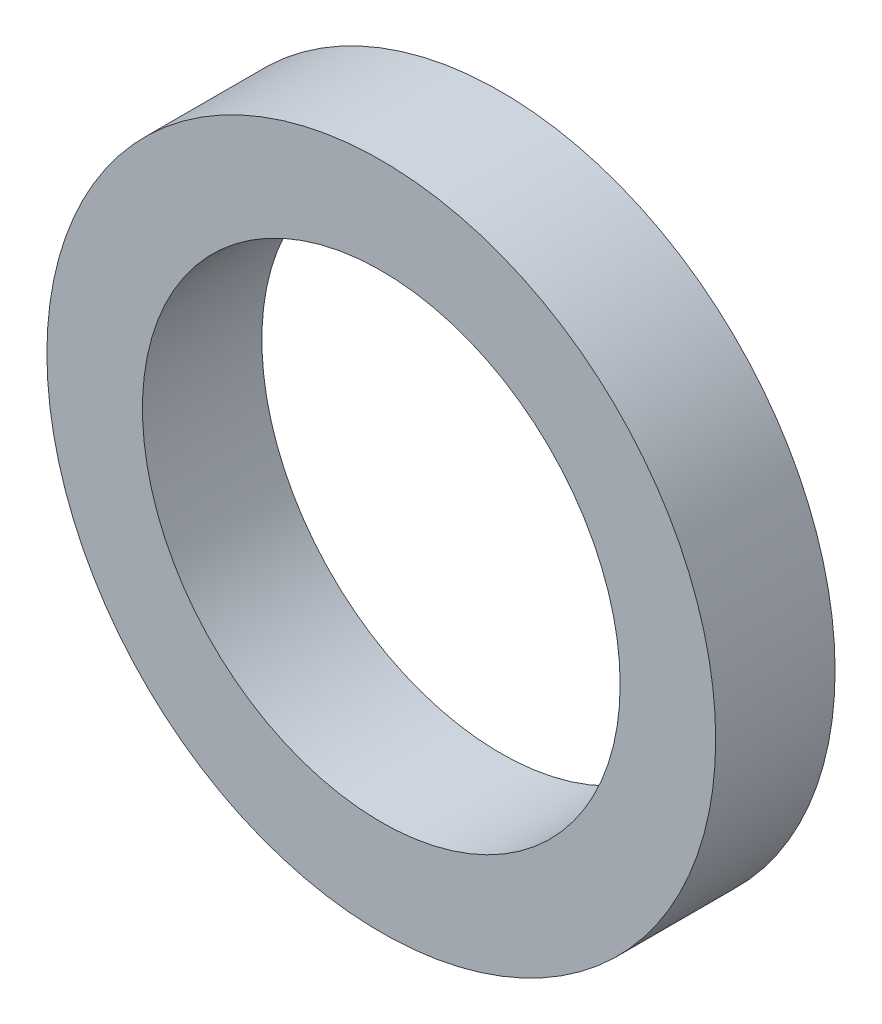
ISO-10303-21;
HEADER;
FILE_DESCRIPTION(('STEP AP214'),'2;1');
FILE_NAME('part.step','',(''),(''),'','','');
FILE_SCHEMA(('AUTOMOTIVE_DESIGN { 1 0 10303 214 1 1 1 1 }'));
ENDSEC;
DATA;
#1=APPLICATION_CONTEXT('core data for automotive mechanical design processes');
#2=APPLICATION_PROTOCOL_DEFINITION('international standard','automotive_design',2000,#1);
#3=PRODUCT_CONTEXT('',#1,'mechanical');
#4=PRODUCT('Part','Part','',(#3));
#5=PRODUCT_RELATED_PRODUCT_CATEGORY('part','',(#4));
#6=PRODUCT_DEFINITION_FORMATION('','',#4);
#7=PRODUCT_DEFINITION_CONTEXT('part definition',#1,'design');
#8=PRODUCT_DEFINITION('design','',#6,#7);
#9=PRODUCT_DEFINITION_SHAPE('','',#8);
#10=(LENGTH_UNIT() NAMED_UNIT(*) SI_UNIT(.MILLI.,.METRE.));
#11=(NAMED_UNIT(*) PLANE_ANGLE_UNIT() SI_UNIT($,.RADIAN.));
#12=(NAMED_UNIT(*) SI_UNIT($,.STERADIAN.) SOLID_ANGLE_UNIT());
#13=UNCERTAINTY_MEASURE_WITH_UNIT(LENGTH_MEASURE(1.E-05),#10,'distance_accuracy_value','');
#14=(GEOMETRIC_REPRESENTATION_CONTEXT(3) GLOBAL_UNCERTAINTY_ASSIGNED_CONTEXT((#13)) GLOBAL_UNIT_ASSIGNED_CONTEXT((#10,
#11,#12)) REPRESENTATION_CONTEXT('',''));
#15=CARTESIAN_POINT('',(0.,0.,0.));
#16=DIRECTION('',(0.,0.,1.));
#17=DIRECTION('',(1.,0.,0.));
#18=AXIS2_PLACEMENT_3D('',#15,#16,#17);
#19=CARTESIAN_POINT('',(0.,0.,3.96748));
#20=DIRECTION('',(0.,0.,1.));
#21=DIRECTION('',(1.,0.,0.));
#22=AXIS2_PLACEMENT_3D('',#19,#20,#21);
#23=PLANE('',#22);
#24=CARTESIAN_POINT('',(0.,0.,3.96748));
#25=DIRECTION('',(0.,0.,1.));
#26=DIRECTION('',(1.,0.,0.));
#27=AXIS2_PLACEMENT_3D('',#24,#25,#26);
#28=CIRCLE('',#27,11.1125);
#29=CARTESIAN_POINT('',(11.1125,0.,3.96748));
#30=VERTEX_POINT('',#29);
#31=EDGE_CURVE('E10',#30,#30,#28,.T.);
#32=ORIENTED_EDGE('',*,*,#31,.T.);
#33=EDGE_LOOP('',(#32));
#34=FACE_BOUND('',#33,.T.);
#35=CARTESIAN_POINT('',(0.,0.,3.96748));
#36=DIRECTION('',(0.,0.,1.));
#37=DIRECTION('',(1.,0.,0.));
#38=AXIS2_PLACEMENT_3D('',#35,#36,#37);
#39=CIRCLE('',#38,7.9375);
#40=CARTESIAN_POINT('',(7.9375,0.,3.96748));
#41=VERTEX_POINT('',#40);
#42=EDGE_CURVE('E41',#41,#41,#39,.T.);
#43=ORIENTED_EDGE('',*,*,#42,.F.);
#44=EDGE_LOOP('',(#43));
#45=FACE_BOUND('',#44,.T.);
#46=ADVANCED_FACE('F30',(#34,#45),#23,.T.);
#47=CARTESIAN_POINT('',(0.,0.,0.));
#48=DIRECTION('',(0.,0.,1.));
#49=DIRECTION('',(1.,0.,0.));
#50=AXIS2_PLACEMENT_3D('',#47,#48,#49);
#51=PLANE('',#50);
#52=CARTESIAN_POINT('',(0.,0.,0.));
#53=DIRECTION('',(0.,0.,1.));
#54=DIRECTION('',(1.,0.,0.));
#55=AXIS2_PLACEMENT_3D('',#52,#53,#54);
#56=CIRCLE('',#55,11.1125);
#57=CARTESIAN_POINT('',(11.1125,0.,0.));
#58=VERTEX_POINT('',#57);
#59=EDGE_CURVE('E34',#58,#58,#56,.T.);
#60=ORIENTED_EDGE('',*,*,#59,.F.);
#61=EDGE_LOOP('',(#60));
#62=FACE_BOUND('',#61,.T.);
#63=CARTESIAN_POINT('',(0.,0.,0.));
#64=DIRECTION('',(0.,0.,1.));
#65=DIRECTION('',(1.,0.,0.));
#66=AXIS2_PLACEMENT_3D('',#63,#64,#65);
#67=CIRCLE('',#66,7.9375);
#68=CARTESIAN_POINT('',(7.9375,0.,0.));
#69=VERTEX_POINT('',#68);
#70=EDGE_CURVE('E43',#69,#69,#67,.T.);
#71=ORIENTED_EDGE('',*,*,#70,.T.);
#72=EDGE_LOOP('',(#71));
#73=FACE_BOUND('',#72,.T.);
#74=ADVANCED_FACE('F53',(#62,#73),#51,.F.);
#75=CARTESIAN_POINT('',(0.,0.,3.96748));
#76=DIRECTION('',(0.,0.,-1.));
#77=DIRECTION('',(-1.,0.,0.));
#78=AXIS2_PLACEMENT_3D('',#75,#76,#77);
#79=CYLINDRICAL_SURFACE('',#78,11.1125);
#80=ORIENTED_EDGE('',*,*,#31,.F.);
#81=EDGE_LOOP('',(#80));
#82=FACE_BOUND('',#81,.T.);
#83=ORIENTED_EDGE('',*,*,#59,.T.);
#84=EDGE_LOOP('',(#83));
#85=FACE_BOUND('',#84,.T.);
#86=ADVANCED_FACE('F32',(#82,#85),#79,.T.);
#87=CARTESIAN_POINT('',(0.,0.,3.96748));
#88=DIRECTION('',(0.,0.,-1.));
#89=DIRECTION('',(-1.,0.,0.));
#90=AXIS2_PLACEMENT_3D('',#87,#88,#89);
#91=CYLINDRICAL_SURFACE('',#90,7.9375);
#92=ORIENTED_EDGE('',*,*,#42,.T.);
#93=EDGE_LOOP('',(#92));
#94=FACE_BOUND('',#93,.T.);
#95=ORIENTED_EDGE('',*,*,#70,.F.);
#96=EDGE_LOOP('',(#95));
#97=FACE_BOUND('',#96,.T.);
#98=ADVANCED_FACE('F49',(#94,#97),#91,.F.);
#99=CLOSED_SHELL('',(#46,#74,#86,#98));
#100=MANIFOLD_SOLID_BREP('B2',#99);
#101=ADVANCED_BREP_SHAPE_REPRESENTATION('',(#18,#100),#14);
#102=SHAPE_DEFINITION_REPRESENTATION(#9,#101);
ENDSEC;
END-ISO-10303-21;
